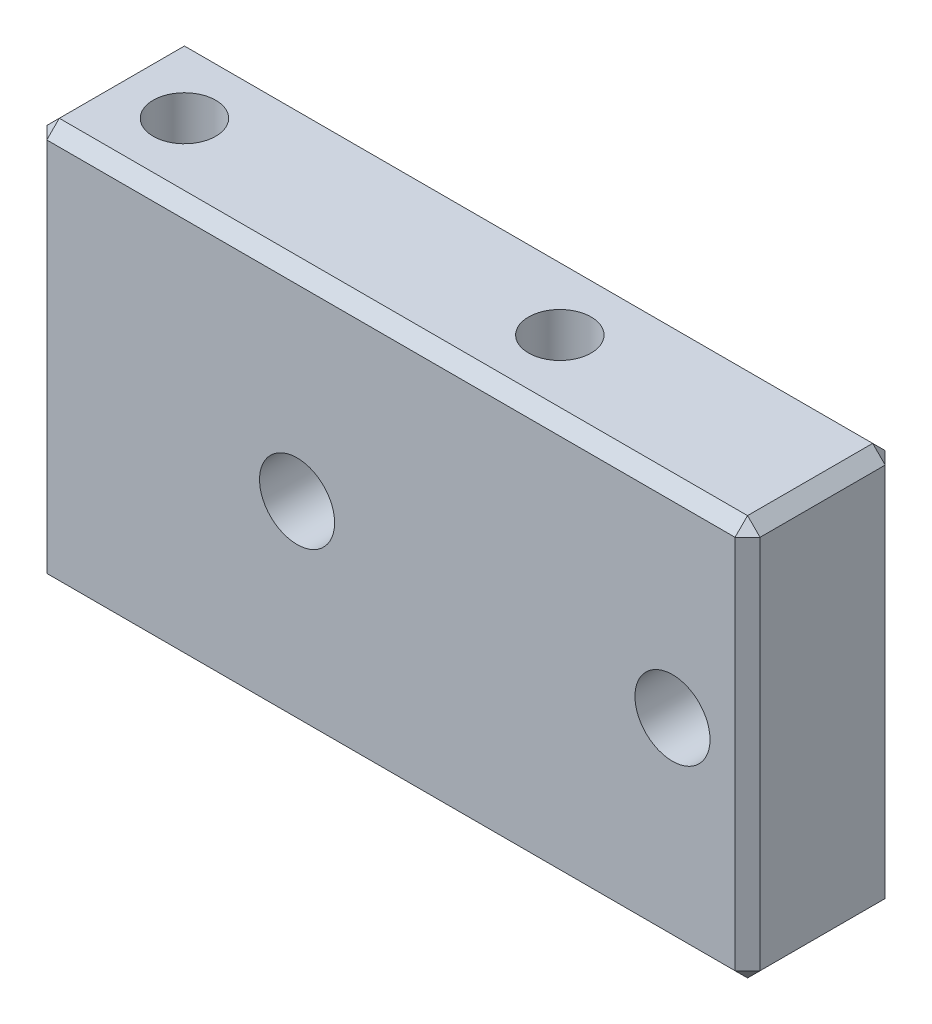
ISO-10303-21;
HEADER;
FILE_DESCRIPTION(('STEP AP214'),'2;1');
FILE_NAME('part.step','',(''),(''),'','','');
FILE_SCHEMA(('AUTOMOTIVE_DESIGN { 1 0 10303 214 1 1 1 1 }'));
ENDSEC;
DATA;
#1=APPLICATION_CONTEXT('core data for automotive mechanical design processes');
#2=APPLICATION_PROTOCOL_DEFINITION('international standard','automotive_design',2000,#1);
#3=PRODUCT_CONTEXT('',#1,'mechanical');
#4=PRODUCT('Part','Part','',(#3));
#5=PRODUCT_RELATED_PRODUCT_CATEGORY('part','',(#4));
#6=PRODUCT_DEFINITION_FORMATION('','',#4);
#7=PRODUCT_DEFINITION_CONTEXT('part definition',#1,'design');
#8=PRODUCT_DEFINITION('design','',#6,#7);
#9=PRODUCT_DEFINITION_SHAPE('','',#8);
#10=(LENGTH_UNIT() NAMED_UNIT(*) SI_UNIT(.MILLI.,.METRE.));
#11=(NAMED_UNIT(*) PLANE_ANGLE_UNIT() SI_UNIT($,.RADIAN.));
#12=(NAMED_UNIT(*) SI_UNIT($,.STERADIAN.) SOLID_ANGLE_UNIT());
#13=UNCERTAINTY_MEASURE_WITH_UNIT(LENGTH_MEASURE(1.E-05),#10,'distance_accuracy_value','');
#14=(GEOMETRIC_REPRESENTATION_CONTEXT(3) GLOBAL_UNCERTAINTY_ASSIGNED_CONTEXT((#13)) GLOBAL_UNIT_ASSIGNED_CONTEXT((#10,
#11,#12)) REPRESENTATION_CONTEXT('',''));
#15=CARTESIAN_POINT('',(0.,0.,0.));
#16=DIRECTION('',(0.,0.,1.));
#17=DIRECTION('',(1.,0.,0.));
#18=AXIS2_PLACEMENT_3D('',#15,#16,#17);
#19=CARTESIAN_POINT('',(-25.5,8.,3.));
#20=DIRECTION('',(0.,-1.,0.));
#21=DIRECTION('',(0.,0.,-1.));
#22=AXIS2_PLACEMENT_3D('',#19,#20,#21);
#23=PLANE('',#22);
#24=DIRECTION('',(-1.,0.,0.));
#25=VECTOR('',#24,1.);
#26=CARTESIAN_POINT('',(-25.5,8.,-2.5));
#27=LINE('',#26,#25);
#28=CARTESIAN_POINT('',(2.5,8.,-2.5));
#29=VERTEX_POINT('',#28);
#30=CARTESIAN_POINT('',(-25.,8.,-2.5));
#31=VERTEX_POINT('',#30);
#32=EDGE_CURVE('E171',#29,#31,#27,.T.);
#33=ORIENTED_EDGE('',*,*,#32,.T.);
#34=DIRECTION('',(0.,0.,1.));
#35=VECTOR('',#34,1.);
#36=CARTESIAN_POINT('',(-25.,8.,3.));
#37=LINE('',#36,#35);
#38=CARTESIAN_POINT('',(-25.,8.,2.5));
#39=VERTEX_POINT('',#38);
#40=EDGE_CURVE('E134',#31,#39,#37,.T.);
#41=ORIENTED_EDGE('',*,*,#40,.T.);
#42=DIRECTION('',(1.,0.,0.));
#43=VECTOR('',#42,1.);
#44=CARTESIAN_POINT('',(-25.5,8.,2.5));
#45=LINE('',#44,#43);
#46=CARTESIAN_POINT('',(2.5,8.,2.5));
#47=VERTEX_POINT('',#46);
#48=EDGE_CURVE('E163',#39,#47,#45,.T.);
#49=ORIENTED_EDGE('',*,*,#48,.T.);
#50=DIRECTION('',(0.,0.,-1.));
#51=VECTOR('',#50,1.);
#52=CARTESIAN_POINT('',(2.5,8.,3.));
#53=LINE('',#52,#51);
#54=EDGE_CURVE('E165',#47,#29,#53,.T.);
#55=ORIENTED_EDGE('',*,*,#54,.T.);
#56=EDGE_LOOP('',(#33,#41,#49,#55));
#57=FACE_BOUND('',#56,.T.);
#58=CARTESIAN_POINT('',(-22.5,8.,0.));
#59=DIRECTION('',(0.,1.,0.));
#60=DIRECTION('',(0.,0.,1.));
#61=AXIS2_PLACEMENT_3D('',#58,#59,#60);
#62=CIRCLE('',#61,1.25);
#63=CARTESIAN_POINT('',(-22.5,8.,1.25));
#64=VERTEX_POINT('',#63);
#65=EDGE_CURVE('E271',#64,#64,#62,.T.);
#66=ORIENTED_EDGE('',*,*,#65,.F.);
#67=EDGE_LOOP('',(#66));
#68=FACE_BOUND('',#67,.T.);
#69=CARTESIAN_POINT('',(-7.5,8.,0.));
#70=DIRECTION('',(0.,1.,0.));
#71=DIRECTION('',(0.,0.,1.));
#72=AXIS2_PLACEMENT_3D('',#69,#70,#71);
#73=CIRCLE('',#72,1.25);
#74=CARTESIAN_POINT('',(-7.5,8.,1.25));
#75=VERTEX_POINT('',#74);
#76=EDGE_CURVE('E260',#75,#75,#73,.T.);
#77=ORIENTED_EDGE('',*,*,#76,.F.);
#78=EDGE_LOOP('',(#77));
#79=FACE_BOUND('',#78,.T.);
#80=ADVANCED_FACE('F36',(#57,#68,#79),#23,.F.);
#81=CARTESIAN_POINT('',(0.,0.,3.));
#82=DIRECTION('',(0.,0.,-1.));
#83=DIRECTION('',(-1.,0.,0.));
#84=AXIS2_PLACEMENT_3D('',#81,#82,#83);
#85=PLANE('',#84);
#86=DIRECTION('',(-1.,0.,0.));
#87=VECTOR('',#86,1.);
#88=CARTESIAN_POINT('',(0.,7.5,3.));
#89=LINE('',#88,#87);
#90=CARTESIAN_POINT('',(2.5,7.5,3.));
#91=VERTEX_POINT('',#90);
#92=CARTESIAN_POINT('',(-25.,7.5,3.));
#93=VERTEX_POINT('',#92);
#94=EDGE_CURVE('E174',#91,#93,#89,.T.);
#95=ORIENTED_EDGE('',*,*,#94,.T.);
#96=DIRECTION('',(0.,-1.,0.));
#97=VECTOR('',#96,1.);
#98=CARTESIAN_POINT('',(-25.,0.,3.));
#99=LINE('',#98,#97);
#100=CARTESIAN_POINT('',(-25.,-7.50000000000001,3.));
#101=VERTEX_POINT('',#100);
#102=EDGE_CURVE('E180',#93,#101,#99,.T.);
#103=ORIENTED_EDGE('',*,*,#102,.T.);
#104=DIRECTION('',(1.,0.,0.));
#105=VECTOR('',#104,1.);
#106=CARTESIAN_POINT('',(0.,-7.5,3.));
#107=LINE('',#106,#105);
#108=CARTESIAN_POINT('',(2.5,-7.5,3.));
#109=VERTEX_POINT('',#108);
#110=EDGE_CURVE('E178',#101,#109,#107,.T.);
#111=ORIENTED_EDGE('',*,*,#110,.T.);
#112=DIRECTION('',(0.,1.,0.));
#113=VECTOR('',#112,1.);
#114=CARTESIAN_POINT('',(2.5,0.,3.));
#115=LINE('',#114,#113);
#116=EDGE_CURVE('E176',#109,#91,#115,.T.);
#117=ORIENTED_EDGE('',*,*,#116,.T.);
#118=EDGE_LOOP('',(#95,#103,#111,#117));
#119=FACE_BOUND('',#118,.T.);
#120=CARTESIAN_POINT('',(0.,0.,3.));
#121=DIRECTION('',(0.,0.,1.));
#122=DIRECTION('',(1.,0.,0.));
#123=AXIS2_PLACEMENT_3D('',#120,#121,#122);
#124=CIRCLE('',#123,1.5);
#125=CARTESIAN_POINT('',(1.5,0.,3.));
#126=VERTEX_POINT('',#125);
#127=EDGE_CURVE('E157',#126,#126,#124,.T.);
#128=ORIENTED_EDGE('',*,*,#127,.F.);
#129=EDGE_LOOP('',(#128));
#130=FACE_BOUND('',#129,.T.);
#131=CARTESIAN_POINT('',(-15.,0.,3.));
#132=DIRECTION('',(0.,0.,1.));
#133=DIRECTION('',(1.,0.,0.));
#134=AXIS2_PLACEMENT_3D('',#131,#132,#133);
#135=CIRCLE('',#134,1.5);
#136=CARTESIAN_POINT('',(-13.5,0.,3.));
#137=VERTEX_POINT('',#136);
#138=EDGE_CURVE('E280',#137,#137,#135,.T.);
#139=ORIENTED_EDGE('',*,*,#138,.F.);
#140=EDGE_LOOP('',(#139));
#141=FACE_BOUND('',#140,.T.);
#142=ADVANCED_FACE('F342',(#119,#130,#141),#85,.F.);
#143=CARTESIAN_POINT('',(0.,0.,-3.));
#144=DIRECTION('',(0.,0.,-1.));
#145=DIRECTION('',(-1.,0.,0.));
#146=AXIS2_PLACEMENT_3D('',#143,#144,#145);
#147=PLANE('',#146);
#148=DIRECTION('',(-1.,0.,0.));
#149=VECTOR('',#148,1.);
#150=CARTESIAN_POINT('',(-25.5,-7.5,-3.));
#151=LINE('',#150,#149);
#152=CARTESIAN_POINT('',(2.5,-7.5,-3.));
#153=VERTEX_POINT('',#152);
#154=CARTESIAN_POINT('',(-25.,-7.5,-3.));
#155=VERTEX_POINT('',#154);
#156=EDGE_CURVE('E196',#153,#155,#151,.T.);
#157=ORIENTED_EDGE('',*,*,#156,.T.);
#158=DIRECTION('',(0.,1.,0.));
#159=VECTOR('',#158,1.);
#160=CARTESIAN_POINT('',(-25.,8.,-3.));
#161=LINE('',#160,#159);
#162=CARTESIAN_POINT('',(-25.,7.5,-3.));
#163=VERTEX_POINT('',#162);
#164=EDGE_CURVE('E198',#155,#163,#161,.T.);
#165=ORIENTED_EDGE('',*,*,#164,.T.);
#166=DIRECTION('',(1.,0.,0.));
#167=VECTOR('',#166,1.);
#168=CARTESIAN_POINT('',(3.,7.5,-3.));
#169=LINE('',#168,#167);
#170=CARTESIAN_POINT('',(2.5,7.5,-3.));
#171=VERTEX_POINT('',#170);
#172=EDGE_CURVE('E192',#163,#171,#169,.T.);
#173=ORIENTED_EDGE('',*,*,#172,.T.);
#174=DIRECTION('',(0.,-1.,0.));
#175=VECTOR('',#174,1.);
#176=CARTESIAN_POINT('',(2.5,-8.,-3.));
#177=LINE('',#176,#175);
#178=EDGE_CURVE('E194',#171,#153,#177,.T.);
#179=ORIENTED_EDGE('',*,*,#178,.T.);
#180=EDGE_LOOP('',(#157,#165,#173,#179));
#181=FACE_BOUND('',#180,.T.);
#182=CARTESIAN_POINT('',(0.,0.,-3.));
#183=DIRECTION('',(0.,0.,1.));
#184=DIRECTION('',(1.,0.,0.));
#185=AXIS2_PLACEMENT_3D('',#182,#183,#184);
#186=CIRCLE('',#185,1.5);
#187=CARTESIAN_POINT('',(1.5,0.,-3.));
#188=VERTEX_POINT('',#187);
#189=EDGE_CURVE('E283',#188,#188,#186,.T.);
#190=ORIENTED_EDGE('',*,*,#189,.T.);
#191=EDGE_LOOP('',(#190));
#192=FACE_BOUND('',#191,.T.);
#193=CARTESIAN_POINT('',(-15.,0.,-3.));
#194=DIRECTION('',(0.,0.,1.));
#195=DIRECTION('',(1.,0.,0.));
#196=AXIS2_PLACEMENT_3D('',#193,#194,#195);
#197=CIRCLE('',#196,1.5);
#198=CARTESIAN_POINT('',(-13.5,0.,-3.));
#199=VERTEX_POINT('',#198);
#200=EDGE_CURVE('E279',#199,#199,#197,.T.);
#201=ORIENTED_EDGE('',*,*,#200,.T.);
#202=EDGE_LOOP('',(#201));
#203=FACE_BOUND('',#202,.T.);
#204=ADVANCED_FACE('F321',(#181,#192,#203),#147,.T.);
#205=CARTESIAN_POINT('',(-25.5,8.,3.));
#206=DIRECTION('',(1.,0.,0.));
#207=DIRECTION('',(0.,0.,-1.));
#208=AXIS2_PLACEMENT_3D('',#205,#206,#207);
#209=PLANE('',#208);
#210=DIRECTION('',(0.,1.,0.));
#211=VECTOR('',#210,1.);
#212=CARTESIAN_POINT('',(-25.5,8.,2.5));
#213=LINE('',#212,#211);
#214=CARTESIAN_POINT('',(-25.5,-7.5,2.5));
#215=VERTEX_POINT('',#214);
#216=CARTESIAN_POINT('',(-25.5,7.5,2.5));
#217=VERTEX_POINT('',#216);
#218=EDGE_CURVE('E161',#215,#217,#213,.T.);
#219=ORIENTED_EDGE('',*,*,#218,.T.);
#220=DIRECTION('',(0.,0.,-1.));
#221=VECTOR('',#220,1.);
#222=CARTESIAN_POINT('',(-25.5,7.5,3.));
#223=LINE('',#222,#221);
#224=CARTESIAN_POINT('',(-25.5,7.5,-2.5));
#225=VERTEX_POINT('',#224);
#226=EDGE_CURVE('E132',#217,#225,#223,.T.);
#227=ORIENTED_EDGE('',*,*,#226,.T.);
#228=DIRECTION('',(0.,-1.,0.));
#229=VECTOR('',#228,1.);
#230=CARTESIAN_POINT('',(-25.5,-8.,-2.5));
#231=LINE('',#230,#229);
#232=CARTESIAN_POINT('',(-25.5,-7.5,-2.5));
#233=VERTEX_POINT('',#232);
#234=EDGE_CURVE('E150',#225,#233,#231,.T.);
#235=ORIENTED_EDGE('',*,*,#234,.T.);
#236=DIRECTION('',(0.,0.,1.));
#237=VECTOR('',#236,1.);
#238=CARTESIAN_POINT('',(-25.5,-7.5,3.));
#239=LINE('',#238,#237);
#240=EDGE_CURVE('E156',#233,#215,#239,.T.);
#241=ORIENTED_EDGE('',*,*,#240,.T.);
#242=EDGE_LOOP('',(#219,#227,#235,#241));
#243=FACE_BOUND('',#242,.T.);
#244=ADVANCED_FACE('F159',(#243),#209,.F.);
#245=CARTESIAN_POINT('',(3.,-8.,3.));
#246=DIRECTION('',(0.,1.,0.));
#247=DIRECTION('',(-1.,0.,0.));
#248=AXIS2_PLACEMENT_3D('',#245,#246,#247);
#249=PLANE('',#248);
#250=DIRECTION('',(0.,0.,1.));
#251=VECTOR('',#250,1.);
#252=CARTESIAN_POINT('',(2.5,-8.,3.));
#253=LINE('',#252,#251);
#254=CARTESIAN_POINT('',(2.5,-8.,-2.5));
#255=VERTEX_POINT('',#254);
#256=CARTESIAN_POINT('',(2.5,-8.,2.5));
#257=VERTEX_POINT('',#256);
#258=EDGE_CURVE('E185',#255,#257,#253,.T.);
#259=ORIENTED_EDGE('',*,*,#258,.T.);
#260=DIRECTION('',(-1.,0.,0.));
#261=VECTOR('',#260,1.);
#262=CARTESIAN_POINT('',(3.,-8.,2.5));
#263=LINE('',#262,#261);
#264=CARTESIAN_POINT('',(-25.,-8.,2.5));
#265=VERTEX_POINT('',#264);
#266=EDGE_CURVE('E190',#257,#265,#263,.T.);
#267=ORIENTED_EDGE('',*,*,#266,.T.);
#268=DIRECTION('',(0.,0.,-1.));
#269=VECTOR('',#268,1.);
#270=CARTESIAN_POINT('',(-25.,-8.,3.));
#271=LINE('',#270,#269);
#272=CARTESIAN_POINT('',(-25.,-8.,-2.5));
#273=VERTEX_POINT('',#272);
#274=EDGE_CURVE('E187',#265,#273,#271,.T.);
#275=ORIENTED_EDGE('',*,*,#274,.T.);
#276=DIRECTION('',(1.,0.,0.));
#277=VECTOR('',#276,1.);
#278=CARTESIAN_POINT('',(3.,-8.,-2.5));
#279=LINE('',#278,#277);
#280=EDGE_CURVE('E183',#273,#255,#279,.T.);
#281=ORIENTED_EDGE('',*,*,#280,.T.);
#282=EDGE_LOOP('',(#259,#267,#275,#281));
#283=FACE_BOUND('',#282,.T.);
#284=CARTESIAN_POINT('',(-7.5,-8.,0.));
#285=DIRECTION('',(0.,1.,0.));
#286=DIRECTION('',(0.,0.,1.));
#287=AXIS2_PLACEMENT_3D('',#284,#285,#286);
#288=CIRCLE('',#287,1.25);
#289=CARTESIAN_POINT('',(-7.5,-8.,1.25));
#290=VERTEX_POINT('',#289);
#291=EDGE_CURVE('E266',#290,#290,#288,.T.);
#292=ORIENTED_EDGE('',*,*,#291,.T.);
#293=EDGE_LOOP('',(#292));
#294=FACE_BOUND('',#293,.T.);
#295=CARTESIAN_POINT('',(-22.5,-8.,0.));
#296=DIRECTION('',(0.,1.,0.));
#297=DIRECTION('',(0.,0.,1.));
#298=AXIS2_PLACEMENT_3D('',#295,#296,#297);
#299=CIRCLE('',#298,1.25);
#300=CARTESIAN_POINT('',(-22.5,-8.,1.25));
#301=VERTEX_POINT('',#300);
#302=EDGE_CURVE('E276',#301,#301,#299,.T.);
#303=ORIENTED_EDGE('',*,*,#302,.T.);
#304=EDGE_LOOP('',(#303));
#305=FACE_BOUND('',#304,.T.);
#306=ADVANCED_FACE('F551',(#283,#294,#305),#249,.F.);
#307=CARTESIAN_POINT('',(3.,8.,3.));
#308=DIRECTION('',(-1.,0.,0.));
#309=DIRECTION('',(0.,-1.,0.));
#310=AXIS2_PLACEMENT_3D('',#307,#308,#309);
#311=PLANE('',#310);
#312=DIRECTION('',(0.,-1.,0.));
#313=VECTOR('',#312,1.);
#314=CARTESIAN_POINT('',(3.,8.,2.5));
#315=LINE('',#314,#313);
#316=CARTESIAN_POINT('',(3.,7.5,2.5));
#317=VERTEX_POINT('',#316);
#318=CARTESIAN_POINT('',(3.,-7.5,2.5));
#319=VERTEX_POINT('',#318);
#320=EDGE_CURVE('E45',#317,#319,#315,.T.);
#321=ORIENTED_EDGE('',*,*,#320,.T.);
#322=DIRECTION('',(0.,0.,-1.));
#323=VECTOR('',#322,1.);
#324=CARTESIAN_POINT('',(3.,-7.5,3.));
#325=LINE('',#324,#323);
#326=CARTESIAN_POINT('',(3.,-7.5,-2.5));
#327=VERTEX_POINT('',#326);
#328=EDGE_CURVE('E11',#319,#327,#325,.T.);
#329=ORIENTED_EDGE('',*,*,#328,.T.);
#330=DIRECTION('',(0.,1.,0.));
#331=VECTOR('',#330,1.);
#332=CARTESIAN_POINT('',(3.,8.,-2.5));
#333=LINE('',#332,#331);
#334=CARTESIAN_POINT('',(3.,7.5,-2.5));
#335=VERTEX_POINT('',#334);
#336=EDGE_CURVE('E59',#327,#335,#333,.T.);
#337=ORIENTED_EDGE('',*,*,#336,.T.);
#338=DIRECTION('',(0.,0.,1.));
#339=VECTOR('',#338,1.);
#340=CARTESIAN_POINT('',(3.,7.5,3.));
#341=LINE('',#340,#339);
#342=EDGE_CURVE('E201',#335,#317,#341,.T.);
#343=ORIENTED_EDGE('',*,*,#342,.T.);
#344=EDGE_LOOP('',(#321,#329,#337,#343));
#345=FACE_BOUND('',#344,.T.);
#346=ADVANCED_FACE('F543',(#345),#311,.F.);
#347=CARTESIAN_POINT('',(0.,0.,3.));
#348=DIRECTION('',(0.,0.,-1.));
#349=DIRECTION('',(-1.,0.,0.));
#350=AXIS2_PLACEMENT_3D('',#347,#348,#349);
#351=CYLINDRICAL_SURFACE('',#350,1.5);
#352=ORIENTED_EDGE('',*,*,#127,.T.);
#353=EDGE_LOOP('',(#352));
#354=FACE_BOUND('',#353,.T.);
#355=ORIENTED_EDGE('',*,*,#189,.F.);
#356=EDGE_LOOP('',(#355));
#357=FACE_BOUND('',#356,.T.);
#358=ADVANCED_FACE('F534',(#354,#357),#351,.F.);
#359=CARTESIAN_POINT('',(-15.,0.,3.));
#360=DIRECTION('',(0.,0.,-1.));
#361=DIRECTION('',(-1.,0.,0.));
#362=AXIS2_PLACEMENT_3D('',#359,#360,#361);
#363=CYLINDRICAL_SURFACE('',#362,1.5);
#364=ORIENTED_EDGE('',*,*,#138,.T.);
#365=EDGE_LOOP('',(#364));
#366=FACE_BOUND('',#365,.T.);
#367=ORIENTED_EDGE('',*,*,#200,.F.);
#368=EDGE_LOOP('',(#367));
#369=FACE_BOUND('',#368,.T.);
#370=ADVANCED_FACE('F519',(#366,#369),#363,.F.);
#371=CARTESIAN_POINT('',(-22.5,8.,0.));
#372=DIRECTION('',(0.,1.,0.));
#373=DIRECTION('',(0.,0.,1.));
#374=AXIS2_PLACEMENT_3D('',#371,#372,#373);
#375=CYLINDRICAL_SURFACE('',#374,1.25);
#376=ORIENTED_EDGE('',*,*,#302,.F.);
#377=EDGE_LOOP('',(#376));
#378=FACE_BOUND('',#377,.T.);
#379=ORIENTED_EDGE('',*,*,#65,.T.);
#380=EDGE_LOOP('',(#379));
#381=FACE_BOUND('',#380,.T.);
#382=ADVANCED_FACE('F509',(#378,#381),#375,.F.);
#383=CARTESIAN_POINT('',(-7.5,8.,0.));
#384=DIRECTION('',(0.,1.,0.));
#385=DIRECTION('',(0.,0.,1.));
#386=AXIS2_PLACEMENT_3D('',#383,#384,#385);
#387=CYLINDRICAL_SURFACE('',#386,1.25);
#388=ORIENTED_EDGE('',*,*,#291,.F.);
#389=EDGE_LOOP('',(#388));
#390=FACE_BOUND('',#389,.T.);
#391=ORIENTED_EDGE('',*,*,#76,.T.);
#392=EDGE_LOOP('',(#391));
#393=FACE_BOUND('',#392,.T.);
#394=ADVANCED_FACE('F500',(#390,#393),#387,.F.);
#395=CARTESIAN_POINT('',(3.,-7.5,3.));
#396=DIRECTION('',(-0.707106781186545,0.70710678118655,0.));
#397=DIRECTION('',(0.,0.,-1.));
#398=AXIS2_PLACEMENT_3D('',#395,#396,#397);
#399=PLANE('',#398);
#400=DIRECTION('',(-0.70710678118655,-0.707106781186545,0.));
#401=VECTOR('',#400,1.);
#402=CARTESIAN_POINT('',(2.5,-8.,2.5));
#403=LINE('',#402,#401);
#404=EDGE_CURVE('E40',#257,#319,#403,.F.);
#405=ORIENTED_EDGE('',*,*,#404,.F.);
#406=ORIENTED_EDGE('',*,*,#258,.F.);
#407=DIRECTION('',(0.70710678118655,0.707106781186545,0.));
#408=VECTOR('',#407,1.);
#409=CARTESIAN_POINT('',(3.,-7.5,-2.5));
#410=LINE('',#409,#408);
#411=EDGE_CURVE('E254',#327,#255,#410,.F.);
#412=ORIENTED_EDGE('',*,*,#411,.F.);
#413=ORIENTED_EDGE('',*,*,#328,.F.);
#414=EDGE_LOOP('',(#405,#406,#412,#413));
#415=FACE_BOUND('',#414,.T.);
#416=ADVANCED_FACE('F38',(#415),#399,.F.);
#417=CARTESIAN_POINT('',(2.5,-8.,2.5));
#418=DIRECTION('',(0.577350269189626,-0.57735026918963,0.577350269189622));
#419=DIRECTION('',(0.70710678118655,0.707106781186545,0.));
#420=AXIS2_PLACEMENT_3D('',#417,#418,#419);
#421=PLANE('',#420);
#422=DIRECTION('',(0.,0.707106781186545,0.70710678118655));
#423=VECTOR('',#422,1.);
#424=CARTESIAN_POINT('',(2.5,-8.,2.5));
#425=LINE('',#424,#423);
#426=EDGE_CURVE('E249',#257,#109,#425,.T.);
#427=ORIENTED_EDGE('',*,*,#426,.F.);
#428=ORIENTED_EDGE('',*,*,#404,.T.);
#429=DIRECTION('',(0.707106781186545,0.,-0.70710678118655));
#430=VECTOR('',#429,1.);
#431=CARTESIAN_POINT('',(2.75,-7.5,2.75));
#432=LINE('',#431,#430);
#433=EDGE_CURVE('E252',#109,#319,#432,.T.);
#434=ORIENTED_EDGE('',*,*,#433,.F.);
#435=EDGE_LOOP('',(#427,#428,#434));
#436=FACE_BOUND('',#435,.T.);
#437=ADVANCED_FACE('F486',(#436),#421,.T.);
#438=CARTESIAN_POINT('',(3.,-7.5,-2.5));
#439=DIRECTION('',(0.577350269189622,-0.577350269189626,-0.57735026918963));
#440=DIRECTION('',(0.,0.70710678118655,-0.707106781186545));
#441=AXIS2_PLACEMENT_3D('',#438,#439,#440);
#442=PLANE('',#441);
#443=DIRECTION('',(0.70710678118655,0.,0.707106781186545));
#444=VECTOR('',#443,1.);
#445=CARTESIAN_POINT('',(3.,-7.5,-2.5));
#446=LINE('',#445,#444);
#447=EDGE_CURVE('E244',#327,#153,#446,.F.);
#448=ORIENTED_EDGE('',*,*,#447,.F.);
#449=ORIENTED_EDGE('',*,*,#411,.T.);
#450=DIRECTION('',(0.,0.70710678118655,-0.707106781186545));
#451=VECTOR('',#450,1.);
#452=CARTESIAN_POINT('',(2.5,-7.75,-2.75));
#453=LINE('',#452,#451);
#454=EDGE_CURVE('E246',#153,#255,#453,.F.);
#455=ORIENTED_EDGE('',*,*,#454,.F.);
#456=EDGE_LOOP('',(#448,#449,#455));
#457=FACE_BOUND('',#456,.T.);
#458=ADVANCED_FACE('F477',(#457),#442,.T.);
#459=CARTESIAN_POINT('',(2.5,0.,3.));
#460=DIRECTION('',(-0.70710678118655,0.,-0.707106781186545));
#461=DIRECTION('',(0.,1.,0.));
#462=AXIS2_PLACEMENT_3D('',#459,#460,#461);
#463=PLANE('',#462);
#464=ORIENTED_EDGE('',*,*,#433,.T.);
#465=ORIENTED_EDGE('',*,*,#320,.F.);
#466=DIRECTION('',(-0.707106781186545,0.,0.70710678118655));
#467=VECTOR('',#466,1.);
#468=CARTESIAN_POINT('',(2.5,7.5,3.));
#469=LINE('',#468,#467);
#470=EDGE_CURVE('E238',#91,#317,#469,.F.);
#471=ORIENTED_EDGE('',*,*,#470,.F.);
#472=ORIENTED_EDGE('',*,*,#116,.F.);
#473=EDGE_LOOP('',(#464,#465,#471,#472));
#474=FACE_BOUND('',#473,.T.);
#475=ADVANCED_FACE('F468',(#474),#463,.F.);
#476=CARTESIAN_POINT('',(0.,-7.5,3.));
#477=DIRECTION('',(0.,0.70710678118655,-0.707106781186545));
#478=DIRECTION('',(1.,0.,0.));
#479=AXIS2_PLACEMENT_3D('',#476,#477,#478);
#480=PLANE('',#479);
#481=ORIENTED_EDGE('',*,*,#426,.T.);
#482=ORIENTED_EDGE('',*,*,#110,.F.);
#483=DIRECTION('',(0.,-0.707106781186545,-0.70710678118655));
#484=VECTOR('',#483,1.);
#485=CARTESIAN_POINT('',(-25.,-7.50000000000001,3.));
#486=LINE('',#485,#484);
#487=EDGE_CURVE('E235',#265,#101,#486,.F.);
#488=ORIENTED_EDGE('',*,*,#487,.F.);
#489=ORIENTED_EDGE('',*,*,#266,.F.);
#490=EDGE_LOOP('',(#481,#482,#488,#489));
#491=FACE_BOUND('',#490,.T.);
#492=ADVANCED_FACE('F460',(#491),#480,.F.);
#493=CARTESIAN_POINT('',(-25.,-8.,3.));
#494=DIRECTION('',(0.707106781186547,0.707106781186547,0.));
#495=DIRECTION('',(0.,0.,-1.));
#496=AXIS2_PLACEMENT_3D('',#493,#494,#495);
#497=PLANE('',#496);
#498=DIRECTION('',(0.707106781186547,-0.707106781186547,0.));
#499=VECTOR('',#498,1.);
#500=CARTESIAN_POINT('',(-25.,-8.,-2.5));
#501=LINE('',#500,#499);
#502=EDGE_CURVE('E229',#273,#233,#501,.F.);
#503=ORIENTED_EDGE('',*,*,#502,.F.);
#504=ORIENTED_EDGE('',*,*,#274,.F.);
#505=DIRECTION('',(-0.707106781186547,0.707106781186547,0.));
#506=VECTOR('',#505,1.);
#507=CARTESIAN_POINT('',(-25.25,-7.75,2.5));
#508=LINE('',#507,#506);
#509=EDGE_CURVE('E232',#215,#265,#508,.F.);
#510=ORIENTED_EDGE('',*,*,#509,.F.);
#511=ORIENTED_EDGE('',*,*,#240,.F.);
#512=EDGE_LOOP('',(#503,#504,#510,#511));
#513=FACE_BOUND('',#512,.T.);
#514=ADVANCED_FACE('F294',(#513),#497,.F.);
#515=CARTESIAN_POINT('',(3.,-8.,-2.5));
#516=DIRECTION('',(0.,-0.707106781186545,-0.70710678118655));
#517=DIRECTION('',(-1.,0.,0.));
#518=AXIS2_PLACEMENT_3D('',#515,#516,#517);
#519=PLANE('',#518);
#520=ORIENTED_EDGE('',*,*,#454,.T.);
#521=ORIENTED_EDGE('',*,*,#280,.F.);
#522=DIRECTION('',(0.,-0.70710678118655,0.707106781186545));
#523=VECTOR('',#522,1.);
#524=CARTESIAN_POINT('',(-25.,-8.,-2.5));
#525=LINE('',#524,#523);
#526=EDGE_CURVE('E227',#155,#273,#525,.T.);
#527=ORIENTED_EDGE('',*,*,#526,.F.);
#528=ORIENTED_EDGE('',*,*,#156,.F.);
#529=EDGE_LOOP('',(#520,#521,#527,#528));
#530=FACE_BOUND('',#529,.T.);
#531=ADVANCED_FACE('F327',(#530),#519,.T.);
#532=CARTESIAN_POINT('',(3.,8.,-2.5));
#533=DIRECTION('',(0.707106781186545,0.,-0.70710678118655));
#534=DIRECTION('',(0.,-1.,0.));
#535=AXIS2_PLACEMENT_3D('',#532,#533,#534);
#536=PLANE('',#535);
#537=ORIENTED_EDGE('',*,*,#447,.T.);
#538=ORIENTED_EDGE('',*,*,#178,.F.);
#539=DIRECTION('',(-0.70710678118655,0.,-0.707106781186545));
#540=VECTOR('',#539,1.);
#541=CARTESIAN_POINT('',(3.,7.5,-2.5));
#542=LINE('',#541,#540);
#543=EDGE_CURVE('E224',#335,#171,#542,.T.);
#544=ORIENTED_EDGE('',*,*,#543,.F.);
#545=ORIENTED_EDGE('',*,*,#336,.F.);
#546=EDGE_LOOP('',(#537,#538,#544,#545));
#547=FACE_BOUND('',#546,.T.);
#548=ADVANCED_FACE('F437',(#547),#536,.T.);
#549=CARTESIAN_POINT('',(2.5,8.,3.));
#550=DIRECTION('',(-0.707106781186545,-0.70710678118655,0.));
#551=DIRECTION('',(0.,0.,-1.));
#552=AXIS2_PLACEMENT_3D('',#549,#550,#551);
#553=PLANE('',#552);
#554=DIRECTION('',(0.70710678118655,-0.707106781186545,0.));
#555=VECTOR('',#554,1.);
#556=CARTESIAN_POINT('',(2.75,7.75,2.5));
#557=LINE('',#556,#555);
#558=EDGE_CURVE('E241',#317,#47,#557,.F.);
#559=ORIENTED_EDGE('',*,*,#558,.F.);
#560=ORIENTED_EDGE('',*,*,#342,.F.);
#561=DIRECTION('',(-0.70710678118655,0.707106781186545,0.));
#562=VECTOR('',#561,1.);
#563=CARTESIAN_POINT('',(3.,7.5,-2.5));
#564=LINE('',#563,#562);
#565=EDGE_CURVE('E221',#29,#335,#564,.F.);
#566=ORIENTED_EDGE('',*,*,#565,.F.);
#567=ORIENTED_EDGE('',*,*,#54,.F.);
#568=EDGE_LOOP('',(#559,#560,#566,#567));
#569=FACE_BOUND('',#568,.T.);
#570=ADVANCED_FACE('F428',(#569),#553,.F.);
#571=CARTESIAN_POINT('',(2.5,7.5,3.));
#572=DIRECTION('',(0.577350269189626,0.57735026918963,0.577350269189622));
#573=DIRECTION('',(-0.70710678118655,0.707106781186545,0.));
#574=AXIS2_PLACEMENT_3D('',#571,#572,#573);
#575=PLANE('',#574);
#576=ORIENTED_EDGE('',*,*,#470,.T.);
#577=ORIENTED_EDGE('',*,*,#558,.T.);
#578=DIRECTION('',(0.,0.707106781186545,-0.70710678118655));
#579=VECTOR('',#578,1.);
#580=CARTESIAN_POINT('',(2.5,7.5,3.));
#581=LINE('',#580,#579);
#582=EDGE_CURVE('E218',#91,#47,#581,.T.);
#583=ORIENTED_EDGE('',*,*,#582,.F.);
#584=EDGE_LOOP('',(#576,#577,#583));
#585=FACE_BOUND('',#584,.T.);
#586=ADVANCED_FACE('F339',(#585),#575,.T.);
#587=CARTESIAN_POINT('',(-25.,-7.50000000000001,3.));
#588=DIRECTION('',(-0.577350269189628,-0.577350269189628,0.57735026918962));
#589=DIRECTION('',(0.707106781186548,-0.707106781186548,0.));
#590=AXIS2_PLACEMENT_3D('',#587,#588,#589);
#591=PLANE('',#590);
#592=ORIENTED_EDGE('',*,*,#509,.T.);
#593=ORIENTED_EDGE('',*,*,#487,.T.);
#594=DIRECTION('',(0.707106781186545,0.,0.70710678118655));
#595=VECTOR('',#594,1.);
#596=CARTESIAN_POINT('',(-25.,-7.50000000000001,3.));
#597=LINE('',#596,#595);
#598=EDGE_CURVE('E216',#215,#101,#597,.T.);
#599=ORIENTED_EDGE('',*,*,#598,.F.);
#600=EDGE_LOOP('',(#592,#593,#599));
#601=FACE_BOUND('',#600,.T.);
#602=ADVANCED_FACE('F297',(#601),#591,.T.);
#603=CARTESIAN_POINT('',(-25.,-8.,-2.5));
#604=DIRECTION('',(-0.577350269189624,-0.577350269189624,-0.577350269189628));
#605=DIRECTION('',(-0.70710678118655,0.,0.707106781186545));
#606=AXIS2_PLACEMENT_3D('',#603,#604,#605);
#607=PLANE('',#606);
#608=ORIENTED_EDGE('',*,*,#526,.T.);
#609=ORIENTED_EDGE('',*,*,#502,.T.);
#610=DIRECTION('',(0.70710678118655,0.,-0.707106781186545));
#611=VECTOR('',#610,1.);
#612=CARTESIAN_POINT('',(-25.25,-7.5,-2.75));
#613=LINE('',#612,#611);
#614=EDGE_CURVE('E153',#155,#233,#613,.F.);
#615=ORIENTED_EDGE('',*,*,#614,.F.);
#616=EDGE_LOOP('',(#608,#609,#615));
#617=FACE_BOUND('',#616,.T.);
#618=ADVANCED_FACE('F329',(#617),#607,.T.);
#619=CARTESIAN_POINT('',(3.,7.5,-2.5));
#620=DIRECTION('',(0.577350269189622,0.57735026918963,-0.577350269189626));
#621=DIRECTION('',(0.,0.707106781186545,0.70710678118655));
#622=AXIS2_PLACEMENT_3D('',#619,#620,#621);
#623=PLANE('',#622);
#624=ORIENTED_EDGE('',*,*,#565,.T.);
#625=ORIENTED_EDGE('',*,*,#543,.T.);
#626=DIRECTION('',(0.,0.707106781186545,0.70710678118655));
#627=VECTOR('',#626,1.);
#628=CARTESIAN_POINT('',(2.5,7.75,-2.75));
#629=LINE('',#628,#627);
#630=EDGE_CURVE('E212',#29,#171,#629,.F.);
#631=ORIENTED_EDGE('',*,*,#630,.F.);
#632=EDGE_LOOP('',(#624,#625,#631));
#633=FACE_BOUND('',#632,.T.);
#634=ADVANCED_FACE('F331',(#633),#623,.T.);
#635=CARTESIAN_POINT('',(0.,7.5,3.));
#636=DIRECTION('',(0.,-0.70710678118655,-0.707106781186545));
#637=DIRECTION('',(-1.,0.,0.));
#638=AXIS2_PLACEMENT_3D('',#635,#636,#637);
#639=PLANE('',#638);
#640=ORIENTED_EDGE('',*,*,#582,.T.);
#641=ORIENTED_EDGE('',*,*,#48,.F.);
#642=DIRECTION('',(0.,-0.707106781186545,0.70710678118655));
#643=VECTOR('',#642,1.);
#644=CARTESIAN_POINT('',(-25.,8.,2.5));
#645=LINE('',#644,#643);
#646=EDGE_CURVE('E209',#93,#39,#645,.F.);
#647=ORIENTED_EDGE('',*,*,#646,.F.);
#648=ORIENTED_EDGE('',*,*,#94,.F.);
#649=EDGE_LOOP('',(#640,#641,#647,#648));
#650=FACE_BOUND('',#649,.T.);
#651=ADVANCED_FACE('F309',(#650),#639,.F.);
#652=CARTESIAN_POINT('',(-25.,0.,3.));
#653=DIRECTION('',(0.70710678118655,0.,-0.707106781186545));
#654=DIRECTION('',(0.,-1.,0.));
#655=AXIS2_PLACEMENT_3D('',#652,#653,#654);
#656=PLANE('',#655);
#657=ORIENTED_EDGE('',*,*,#598,.T.);
#658=ORIENTED_EDGE('',*,*,#102,.F.);
#659=DIRECTION('',(-0.707106781186545,0.,-0.70710678118655));
#660=VECTOR('',#659,1.);
#661=CARTESIAN_POINT('',(-25.25,7.5,2.75));
#662=LINE('',#661,#660);
#663=EDGE_CURVE('E147',#217,#93,#662,.F.);
#664=ORIENTED_EDGE('',*,*,#663,.F.);
#665=ORIENTED_EDGE('',*,*,#218,.F.);
#666=EDGE_LOOP('',(#657,#658,#664,#665));
#667=FACE_BOUND('',#666,.T.);
#668=ADVANCED_FACE('F301',(#667),#656,.F.);
#669=CARTESIAN_POINT('',(-25.5,8.,-2.5));
#670=DIRECTION('',(-0.707106781186545,0.,-0.70710678118655));
#671=DIRECTION('',(0.,1.,0.));
#672=AXIS2_PLACEMENT_3D('',#669,#670,#671);
#673=PLANE('',#672);
#674=ORIENTED_EDGE('',*,*,#614,.T.);
#675=ORIENTED_EDGE('',*,*,#234,.F.);
#676=DIRECTION('',(-0.70710678118655,0.,0.707106781186545));
#677=VECTOR('',#676,1.);
#678=CARTESIAN_POINT('',(-25.5,7.5,-2.5));
#679=LINE('',#678,#677);
#680=EDGE_CURVE('E139',#163,#225,#679,.T.);
#681=ORIENTED_EDGE('',*,*,#680,.F.);
#682=ORIENTED_EDGE('',*,*,#164,.F.);
#683=EDGE_LOOP('',(#674,#675,#681,#682));
#684=FACE_BOUND('',#683,.T.);
#685=ADVANCED_FACE('F151',(#684),#673,.T.);
#686=CARTESIAN_POINT('',(-25.5,8.,-2.5));
#687=DIRECTION('',(0.,0.70710678118655,-0.707106781186545));
#688=DIRECTION('',(1.,0.,0.));
#689=AXIS2_PLACEMENT_3D('',#686,#687,#688);
#690=PLANE('',#689);
#691=ORIENTED_EDGE('',*,*,#630,.T.);
#692=ORIENTED_EDGE('',*,*,#172,.F.);
#693=DIRECTION('',(0.,-0.707106781186545,-0.70710678118655));
#694=VECTOR('',#693,1.);
#695=CARTESIAN_POINT('',(-25.,7.75,-2.75));
#696=LINE('',#695,#694);
#697=EDGE_CURVE('E143',#31,#163,#696,.T.);
#698=ORIENTED_EDGE('',*,*,#697,.F.);
#699=ORIENTED_EDGE('',*,*,#32,.F.);
#700=EDGE_LOOP('',(#691,#692,#698,#699));
#701=FACE_BOUND('',#700,.T.);
#702=ADVANCED_FACE('F317',(#701),#690,.T.);
#703=CARTESIAN_POINT('',(-25.,8.,2.5));
#704=DIRECTION('',(-0.577350269189626,0.57735026918963,0.577350269189622));
#705=DIRECTION('',(-0.70710678118655,-0.707106781186545,0.));
#706=AXIS2_PLACEMENT_3D('',#703,#704,#705);
#707=PLANE('',#706);
#708=ORIENTED_EDGE('',*,*,#663,.T.);
#709=ORIENTED_EDGE('',*,*,#646,.T.);
#710=DIRECTION('',(0.70710678118655,0.707106781186545,0.));
#711=VECTOR('',#710,1.);
#712=CARTESIAN_POINT('',(-25.,8.,2.5));
#713=LINE('',#712,#711);
#714=EDGE_CURVE('E136',#217,#39,#713,.T.);
#715=ORIENTED_EDGE('',*,*,#714,.F.);
#716=EDGE_LOOP('',(#708,#709,#715));
#717=FACE_BOUND('',#716,.T.);
#718=ADVANCED_FACE('F305',(#717),#707,.T.);
#719=CARTESIAN_POINT('',(-25.5,7.5,-2.5));
#720=DIRECTION('',(-0.577350269189622,0.57735026918963,-0.577350269189626));
#721=DIRECTION('',(0.,0.707106781186545,0.70710678118655));
#722=AXIS2_PLACEMENT_3D('',#719,#720,#721);
#723=PLANE('',#722);
#724=ORIENTED_EDGE('',*,*,#697,.T.);
#725=ORIENTED_EDGE('',*,*,#680,.T.);
#726=DIRECTION('',(-0.70710678118655,-0.707106781186545,0.));
#727=VECTOR('',#726,1.);
#728=CARTESIAN_POINT('',(-25.5,7.5,-2.5));
#729=LINE('',#728,#727);
#730=EDGE_CURVE('E128',#31,#225,#729,.T.);
#731=ORIENTED_EDGE('',*,*,#730,.F.);
#732=EDGE_LOOP('',(#724,#725,#731));
#733=FACE_BOUND('',#732,.T.);
#734=ADVANCED_FACE('F141',(#733),#723,.T.);
#735=CARTESIAN_POINT('',(-25.5,7.5,3.));
#736=DIRECTION('',(0.707106781186545,-0.70710678118655,0.));
#737=DIRECTION('',(0.,0.,-1.));
#738=AXIS2_PLACEMENT_3D('',#735,#736,#737);
#739=PLANE('',#738);
#740=ORIENTED_EDGE('',*,*,#714,.T.);
#741=ORIENTED_EDGE('',*,*,#40,.F.);
#742=ORIENTED_EDGE('',*,*,#730,.T.);
#743=ORIENTED_EDGE('',*,*,#226,.F.);
#744=EDGE_LOOP('',(#740,#741,#742,#743));
#745=FACE_BOUND('',#744,.T.);
#746=ADVANCED_FACE('F130',(#745),#739,.F.);
#747=CLOSED_SHELL('',(#80,#142,#204,#244,#306,#346,#358,#370,#382,#394,#416,#437,#458,#475,#492,
#514,#531,#548,#570,#586,#602,#618,#634,#651,#668,#685,#702,#718,#734,#746));
#748=MANIFOLD_SOLID_BREP('B2',#747);
#749=ADVANCED_BREP_SHAPE_REPRESENTATION('',(#18,#748),#14);
#750=SHAPE_DEFINITION_REPRESENTATION(#9,#749);
ENDSEC;
END-ISO-10303-21;
